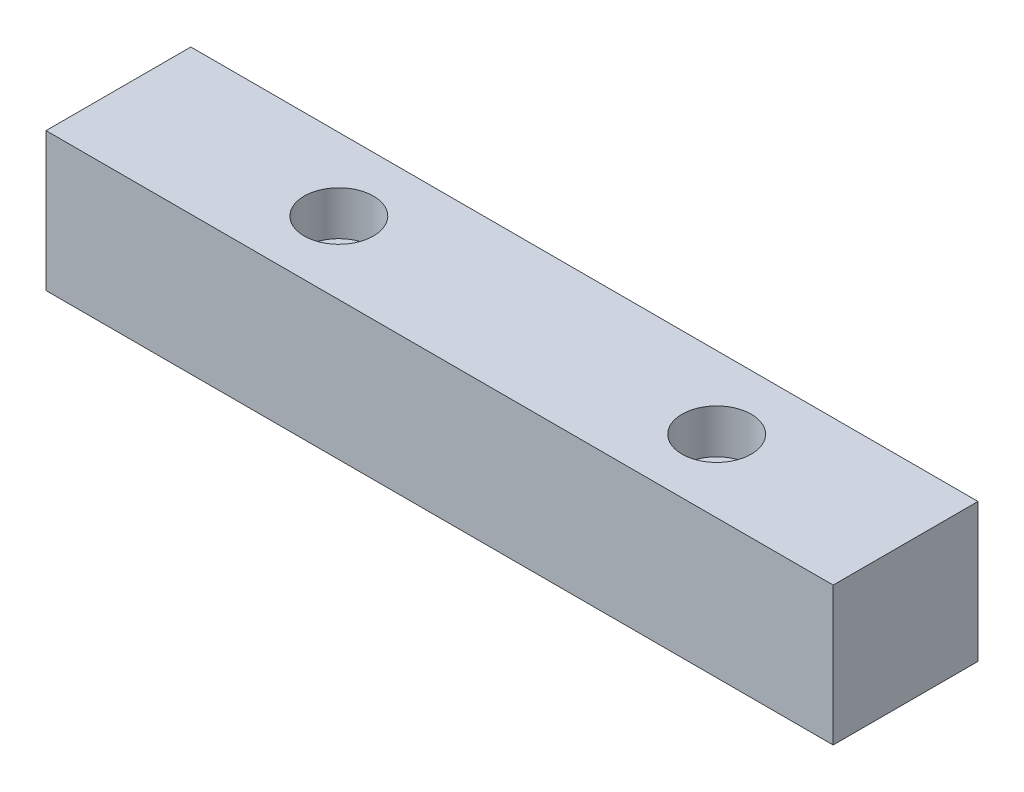
ISO-10303-21;
HEADER;
FILE_DESCRIPTION(('STEP AP214'),'2;1');
FILE_NAME('part.step','',(''),(''),'','','');
FILE_SCHEMA(('AUTOMOTIVE_DESIGN { 1 0 10303 214 1 1 1 1 }'));
ENDSEC;
DATA;
#1=APPLICATION_CONTEXT('core data for automotive mechanical design processes');
#2=APPLICATION_PROTOCOL_DEFINITION('international standard','automotive_design',2000,#1);
#3=PRODUCT_CONTEXT('',#1,'mechanical');
#4=PRODUCT('Part','Part','',(#3));
#5=PRODUCT_RELATED_PRODUCT_CATEGORY('part','',(#4));
#6=PRODUCT_DEFINITION_FORMATION('','',#4);
#7=PRODUCT_DEFINITION_CONTEXT('part definition',#1,'design');
#8=PRODUCT_DEFINITION('design','',#6,#7);
#9=PRODUCT_DEFINITION_SHAPE('','',#8);
#10=(LENGTH_UNIT() NAMED_UNIT(*) SI_UNIT(.MILLI.,.METRE.));
#11=(NAMED_UNIT(*) PLANE_ANGLE_UNIT() SI_UNIT($,.RADIAN.));
#12=(NAMED_UNIT(*) SI_UNIT($,.STERADIAN.) SOLID_ANGLE_UNIT());
#13=UNCERTAINTY_MEASURE_WITH_UNIT(LENGTH_MEASURE(1.E-05),#10,'distance_accuracy_value','');
#14=(GEOMETRIC_REPRESENTATION_CONTEXT(3) GLOBAL_UNCERTAINTY_ASSIGNED_CONTEXT((#13)) GLOBAL_UNIT_ASSIGNED_CONTEXT((#10,
#11,#12)) REPRESENTATION_CONTEXT('',''));
#15=CARTESIAN_POINT('',(0.,0.,0.));
#16=DIRECTION('',(0.,0.,1.));
#17=DIRECTION('',(1.,0.,0.));
#18=AXIS2_PLACEMENT_3D('',#15,#16,#17);
#19=CARTESIAN_POINT('',(125.,-11.,-11.5));
#20=DIRECTION('',(0.,0.,1.));
#21=DIRECTION('',(1.,0.,0.));
#22=AXIS2_PLACEMENT_3D('',#19,#20,#21);
#23=PLANE('',#22);
#24=DIRECTION('',(0.,1.,0.));
#25=VECTOR('',#24,1.);
#26=CARTESIAN_POINT('',(0.,-11.,-11.5));
#27=LINE('',#26,#25);
#28=CARTESIAN_POINT('',(0.,-11.,-11.5));
#29=VERTEX_POINT('',#28);
#30=CARTESIAN_POINT('',(0.,11.,-11.5));
#31=VERTEX_POINT('',#30);
#32=EDGE_CURVE('E97',#29,#31,#27,.T.);
#33=ORIENTED_EDGE('',*,*,#32,.T.);
#34=DIRECTION('',(-1.,0.,0.));
#35=VECTOR('',#34,1.);
#36=CARTESIAN_POINT('',(125.,11.,-11.5));
#37=LINE('',#36,#35);
#38=CARTESIAN_POINT('',(125.,11.,-11.5));
#39=VERTEX_POINT('',#38);
#40=EDGE_CURVE('E11',#39,#31,#37,.T.);
#41=ORIENTED_EDGE('',*,*,#40,.F.);
#42=DIRECTION('',(0.,1.,0.));
#43=VECTOR('',#42,1.);
#44=CARTESIAN_POINT('',(125.,-11.,-11.5));
#45=LINE('',#44,#43);
#46=CARTESIAN_POINT('',(125.,-11.,-11.5));
#47=VERTEX_POINT('',#46);
#48=EDGE_CURVE('E85',#47,#39,#45,.T.);
#49=ORIENTED_EDGE('',*,*,#48,.F.);
#50=DIRECTION('',(-1.,0.,0.));
#51=VECTOR('',#50,1.);
#52=CARTESIAN_POINT('',(125.,-11.,-11.5));
#53=LINE('',#52,#51);
#54=EDGE_CURVE('E93',#47,#29,#53,.T.);
#55=ORIENTED_EDGE('',*,*,#54,.T.);
#56=EDGE_LOOP('',(#33,#41,#49,#55));
#57=FACE_BOUND('',#56,.T.);
#58=ADVANCED_FACE('F34',(#57),#23,.F.);
#59=CARTESIAN_POINT('',(125.,11.,11.5));
#60=DIRECTION('',(0.,-1.,0.));
#61=DIRECTION('',(0.,0.,-1.));
#62=AXIS2_PLACEMENT_3D('',#59,#60,#61);
#63=PLANE('',#62);
#64=CARTESIAN_POINT('',(95.,11.,0.));
#65=DIRECTION('',(0.,1.,0.));
#66=DIRECTION('',(0.,0.,1.));
#67=AXIS2_PLACEMENT_3D('',#64,#65,#66);
#68=CIRCLE('',#67,5.50000000000001);
#69=CARTESIAN_POINT('',(95.,11.,5.50000000000001));
#70=VERTEX_POINT('',#69);
#71=EDGE_CURVE('E131',#70,#70,#68,.T.);
#72=ORIENTED_EDGE('',*,*,#71,.F.);
#73=EDGE_LOOP('',(#72));
#74=FACE_BOUND('',#73,.T.);
#75=CARTESIAN_POINT('',(35.,11.,0.));
#76=DIRECTION('',(0.,1.,0.));
#77=DIRECTION('',(0.,0.,1.));
#78=AXIS2_PLACEMENT_3D('',#75,#76,#77);
#79=CIRCLE('',#78,5.5);
#80=CARTESIAN_POINT('',(35.,11.,5.5));
#81=VERTEX_POINT('',#80);
#82=EDGE_CURVE('E119',#81,#81,#79,.T.);
#83=ORIENTED_EDGE('',*,*,#82,.F.);
#84=EDGE_LOOP('',(#83));
#85=FACE_BOUND('',#84,.T.);
#86=DIRECTION('',(0.,0.,1.));
#87=VECTOR('',#86,1.);
#88=CARTESIAN_POINT('',(0.,11.,11.5));
#89=LINE('',#88,#87);
#90=CARTESIAN_POINT('',(0.,11.,11.5));
#91=VERTEX_POINT('',#90);
#92=EDGE_CURVE('E89',#31,#91,#89,.T.);
#93=ORIENTED_EDGE('',*,*,#92,.T.);
#94=DIRECTION('',(-1.,0.,0.));
#95=VECTOR('',#94,1.);
#96=CARTESIAN_POINT('',(125.,11.,11.5));
#97=LINE('',#96,#95);
#98=CARTESIAN_POINT('',(125.,11.,11.5));
#99=VERTEX_POINT('',#98);
#100=EDGE_CURVE('E42',#99,#91,#97,.T.);
#101=ORIENTED_EDGE('',*,*,#100,.F.);
#102=DIRECTION('',(0.,0.,1.));
#103=VECTOR('',#102,1.);
#104=CARTESIAN_POINT('',(125.,11.,11.5));
#105=LINE('',#104,#103);
#106=EDGE_CURVE('E80',#39,#99,#105,.T.);
#107=ORIENTED_EDGE('',*,*,#106,.F.);
#108=ORIENTED_EDGE('',*,*,#40,.T.);
#109=EDGE_LOOP('',(#93,#101,#107,#108));
#110=FACE_BOUND('',#109,.T.);
#111=ADVANCED_FACE('F88',(#74,#85,#110),#63,.F.);
#112=CARTESIAN_POINT('',(125.,-11.,11.5));
#113=DIRECTION('',(0.,0.,-1.));
#114=DIRECTION('',(-1.,0.,0.));
#115=AXIS2_PLACEMENT_3D('',#112,#113,#114);
#116=PLANE('',#115);
#117=DIRECTION('',(0.,-1.,0.));
#118=VECTOR('',#117,1.);
#119=CARTESIAN_POINT('',(0.,-11.,11.5));
#120=LINE('',#119,#118);
#121=CARTESIAN_POINT('',(0.,-11.,11.5));
#122=VERTEX_POINT('',#121);
#123=EDGE_CURVE('E67',#91,#122,#120,.T.);
#124=ORIENTED_EDGE('',*,*,#123,.T.);
#125=DIRECTION('',(-1.,0.,0.));
#126=VECTOR('',#125,1.);
#127=CARTESIAN_POINT('',(125.,-11.,11.5));
#128=LINE('',#127,#126);
#129=CARTESIAN_POINT('',(125.,-11.,11.5));
#130=VERTEX_POINT('',#129);
#131=EDGE_CURVE('E90',#130,#122,#128,.T.);
#132=ORIENTED_EDGE('',*,*,#131,.F.);
#133=DIRECTION('',(0.,-1.,0.));
#134=VECTOR('',#133,1.);
#135=CARTESIAN_POINT('',(125.,-11.,11.5));
#136=LINE('',#135,#134);
#137=EDGE_CURVE('E83',#99,#130,#136,.T.);
#138=ORIENTED_EDGE('',*,*,#137,.F.);
#139=ORIENTED_EDGE('',*,*,#100,.T.);
#140=EDGE_LOOP('',(#124,#132,#138,#139));
#141=FACE_BOUND('',#140,.T.);
#142=ADVANCED_FACE('F91',(#141),#116,.F.);
#143=CARTESIAN_POINT('',(125.,-11.,11.5));
#144=DIRECTION('',(0.,1.,0.));
#145=DIRECTION('',(0.,0.,1.));
#146=AXIS2_PLACEMENT_3D('',#143,#144,#145);
#147=PLANE('',#146);
#148=CARTESIAN_POINT('',(95.,-11.,0.));
#149=DIRECTION('',(0.,1.,0.));
#150=DIRECTION('',(0.,0.,1.));
#151=AXIS2_PLACEMENT_3D('',#148,#149,#150);
#152=CIRCLE('',#151,3.24999999999999);
#153=CARTESIAN_POINT('',(95.,-11.,3.24999999999999));
#154=VERTEX_POINT('',#153);
#155=EDGE_CURVE('E122',#154,#154,#152,.T.);
#156=ORIENTED_EDGE('',*,*,#155,.T.);
#157=EDGE_LOOP('',(#156));
#158=FACE_BOUND('',#157,.T.);
#159=CARTESIAN_POINT('',(35.,-11.,0.));
#160=DIRECTION('',(0.,1.,0.));
#161=DIRECTION('',(0.,0.,1.));
#162=AXIS2_PLACEMENT_3D('',#159,#160,#161);
#163=CIRCLE('',#162,3.25);
#164=CARTESIAN_POINT('',(35.,-11.,3.25));
#165=VERTEX_POINT('',#164);
#166=EDGE_CURVE('E100',#165,#165,#163,.T.);
#167=ORIENTED_EDGE('',*,*,#166,.T.);
#168=EDGE_LOOP('',(#167));
#169=FACE_BOUND('',#168,.T.);
#170=DIRECTION('',(0.,0.,-1.));
#171=VECTOR('',#170,1.);
#172=CARTESIAN_POINT('',(0.,-11.,11.5));
#173=LINE('',#172,#171);
#174=EDGE_CURVE('E73',#122,#29,#173,.T.);
#175=ORIENTED_EDGE('',*,*,#174,.T.);
#176=ORIENTED_EDGE('',*,*,#54,.F.);
#177=DIRECTION('',(0.,0.,-1.));
#178=VECTOR('',#177,1.);
#179=CARTESIAN_POINT('',(125.,-11.,11.5));
#180=LINE('',#179,#178);
#181=EDGE_CURVE('E50',#130,#47,#180,.T.);
#182=ORIENTED_EDGE('',*,*,#181,.F.);
#183=ORIENTED_EDGE('',*,*,#131,.T.);
#184=EDGE_LOOP('',(#175,#176,#182,#183));
#185=FACE_BOUND('',#184,.T.);
#186=ADVANCED_FACE('F105',(#158,#169,#185),#147,.F.);
#187=CARTESIAN_POINT('',(125.,0.,0.));
#188=DIRECTION('',(-1.,0.,0.));
#189=DIRECTION('',(0.,0.,1.));
#190=AXIS2_PLACEMENT_3D('',#187,#188,#189);
#191=PLANE('',#190);
#192=ORIENTED_EDGE('',*,*,#48,.T.);
#193=ORIENTED_EDGE('',*,*,#106,.T.);
#194=ORIENTED_EDGE('',*,*,#137,.T.);
#195=ORIENTED_EDGE('',*,*,#181,.T.);
#196=EDGE_LOOP('',(#192,#193,#194,#195));
#197=FACE_BOUND('',#196,.T.);
#198=ADVANCED_FACE('F81',(#197),#191,.F.);
#199=CARTESIAN_POINT('',(0.,0.,0.));
#200=DIRECTION('',(-1.,0.,0.));
#201=DIRECTION('',(0.,0.,1.));
#202=AXIS2_PLACEMENT_3D('',#199,#200,#201);
#203=PLANE('',#202);
#204=ORIENTED_EDGE('',*,*,#32,.F.);
#205=ORIENTED_EDGE('',*,*,#174,.F.);
#206=ORIENTED_EDGE('',*,*,#123,.F.);
#207=ORIENTED_EDGE('',*,*,#92,.F.);
#208=EDGE_LOOP('',(#204,#205,#206,#207));
#209=FACE_BOUND('',#208,.T.);
#210=ADVANCED_FACE('F108',(#209),#203,.T.);
#211=CARTESIAN_POINT('',(35.,11.,0.));
#212=DIRECTION('',(0.,1.,0.));
#213=DIRECTION('',(0.,0.,1.));
#214=AXIS2_PLACEMENT_3D('',#211,#212,#213);
#215=CYLINDRICAL_SURFACE('',#214,3.25);
#216=ORIENTED_EDGE('',*,*,#166,.F.);
#217=EDGE_LOOP('',(#216));
#218=FACE_BOUND('',#217,.T.);
#219=CARTESIAN_POINT('',(35.,4.,0.));
#220=DIRECTION('',(0.,1.,0.));
#221=DIRECTION('',(0.,0.,1.));
#222=AXIS2_PLACEMENT_3D('',#219,#220,#221);
#223=CIRCLE('',#222,3.25);
#224=CARTESIAN_POINT('',(35.,4.,3.25));
#225=VERTEX_POINT('',#224);
#226=EDGE_CURVE('E113',#225,#225,#223,.T.);
#227=ORIENTED_EDGE('',*,*,#226,.T.);
#228=EDGE_LOOP('',(#227));
#229=FACE_BOUND('',#228,.T.);
#230=ADVANCED_FACE('F154',(#218,#229),#215,.F.);
#231=CARTESIAN_POINT('',(38.25,4.,0.));
#232=DIRECTION('',(0.,-1.,0.));
#233=DIRECTION('',(0.,0.,-1.));
#234=AXIS2_PLACEMENT_3D('',#231,#232,#233);
#235=PLANE('',#234);
#236=ORIENTED_EDGE('',*,*,#226,.F.);
#237=EDGE_LOOP('',(#236));
#238=FACE_BOUND('',#237,.T.);
#239=CARTESIAN_POINT('',(35.,4.,0.));
#240=DIRECTION('',(0.,1.,0.));
#241=DIRECTION('',(0.,0.,1.));
#242=AXIS2_PLACEMENT_3D('',#239,#240,#241);
#243=CIRCLE('',#242,5.5);
#244=CARTESIAN_POINT('',(35.,4.,5.5));
#245=VERTEX_POINT('',#244);
#246=EDGE_CURVE('E116',#245,#245,#243,.T.);
#247=ORIENTED_EDGE('',*,*,#246,.T.);
#248=EDGE_LOOP('',(#247));
#249=FACE_BOUND('',#248,.T.);
#250=ADVANCED_FACE('F144',(#238,#249),#235,.F.);
#251=CARTESIAN_POINT('',(35.,11.,0.));
#252=DIRECTION('',(0.,1.,0.));
#253=DIRECTION('',(0.,0.,1.));
#254=AXIS2_PLACEMENT_3D('',#251,#252,#253);
#255=CYLINDRICAL_SURFACE('',#254,5.5);
#256=ORIENTED_EDGE('',*,*,#246,.F.);
#257=EDGE_LOOP('',(#256));
#258=FACE_BOUND('',#257,.T.);
#259=ORIENTED_EDGE('',*,*,#82,.T.);
#260=EDGE_LOOP('',(#259));
#261=FACE_BOUND('',#260,.T.);
#262=ADVANCED_FACE('F141',(#258,#261),#255,.F.);
#263=CARTESIAN_POINT('',(95.,11.,0.));
#264=DIRECTION('',(0.,1.,0.));
#265=DIRECTION('',(0.,0.,1.));
#266=AXIS2_PLACEMENT_3D('',#263,#264,#265);
#267=CYLINDRICAL_SURFACE('',#266,3.25);
#268=ORIENTED_EDGE('',*,*,#155,.F.);
#269=EDGE_LOOP('',(#268));
#270=FACE_BOUND('',#269,.T.);
#271=CARTESIAN_POINT('',(95.,4.,0.));
#272=DIRECTION('',(0.,1.,0.));
#273=DIRECTION('',(0.,0.,1.));
#274=AXIS2_PLACEMENT_3D('',#271,#272,#273);
#275=CIRCLE('',#274,3.25);
#276=CARTESIAN_POINT('',(95.,4.,3.25));
#277=VERTEX_POINT('',#276);
#278=EDGE_CURVE('E125',#277,#277,#275,.T.);
#279=ORIENTED_EDGE('',*,*,#278,.T.);
#280=EDGE_LOOP('',(#279));
#281=FACE_BOUND('',#280,.T.);
#282=ADVANCED_FACE('F143',(#270,#281),#267,.F.);
#283=CARTESIAN_POINT('',(98.25,4.,0.));
#284=DIRECTION('',(0.,-1.,0.));
#285=DIRECTION('',(0.,0.,-1.));
#286=AXIS2_PLACEMENT_3D('',#283,#284,#285);
#287=PLANE('',#286);
#288=ORIENTED_EDGE('',*,*,#278,.F.);
#289=EDGE_LOOP('',(#288));
#290=FACE_BOUND('',#289,.T.);
#291=CARTESIAN_POINT('',(95.,4.,0.));
#292=DIRECTION('',(0.,1.,0.));
#293=DIRECTION('',(0.,0.,1.));
#294=AXIS2_PLACEMENT_3D('',#291,#292,#293);
#295=CIRCLE('',#294,5.50000000000001);
#296=CARTESIAN_POINT('',(95.,4.,5.50000000000001));
#297=VERTEX_POINT('',#296);
#298=EDGE_CURVE('E128',#297,#297,#295,.T.);
#299=ORIENTED_EDGE('',*,*,#298,.T.);
#300=EDGE_LOOP('',(#299));
#301=FACE_BOUND('',#300,.T.);
#302=ADVANCED_FACE('F151',(#290,#301),#287,.F.);
#303=CARTESIAN_POINT('',(95.,11.,0.));
#304=DIRECTION('',(0.,1.,0.));
#305=DIRECTION('',(0.,0.,1.));
#306=AXIS2_PLACEMENT_3D('',#303,#304,#305);
#307=CYLINDRICAL_SURFACE('',#306,5.50000000000001);
#308=ORIENTED_EDGE('',*,*,#298,.F.);
#309=EDGE_LOOP('',(#308));
#310=FACE_BOUND('',#309,.T.);
#311=ORIENTED_EDGE('',*,*,#71,.T.);
#312=EDGE_LOOP('',(#311));
#313=FACE_BOUND('',#312,.T.);
#314=ADVANCED_FACE('F135',(#310,#313),#307,.F.);
#315=CLOSED_SHELL('',(#58,#111,#142,#186,#198,#210,#230,#250,#262,#282,#302,#314));
#316=MANIFOLD_SOLID_BREP('B2',#315);
#317=ADVANCED_BREP_SHAPE_REPRESENTATION('',(#18,#316),#14);
#318=SHAPE_DEFINITION_REPRESENTATION(#9,#317);
ENDSEC;
END-ISO-10303-21;
